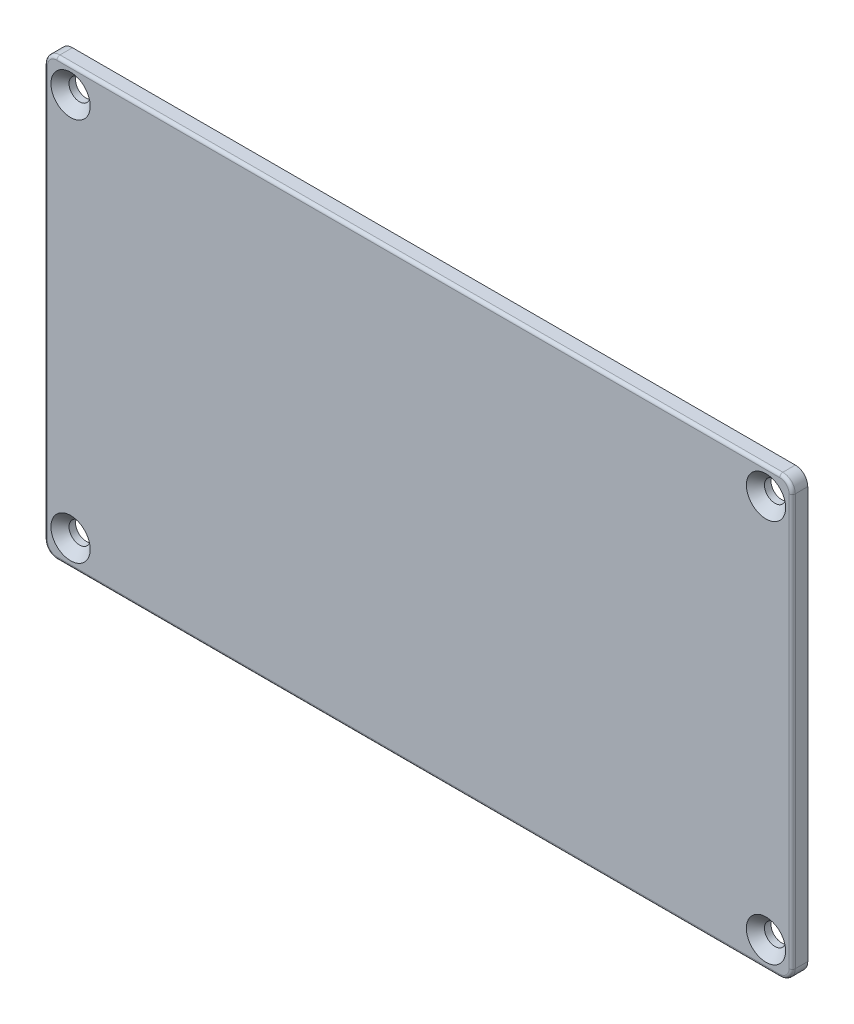
ISO-10303-21;
HEADER;
FILE_DESCRIPTION(('STEP AP214'),'2;1');
FILE_NAME('part.step','',(''),(''),'','','');
FILE_SCHEMA(('AUTOMOTIVE_DESIGN { 1 0 10303 214 1 1 1 1 }'));
ENDSEC;
DATA;
#1=APPLICATION_CONTEXT('core data for automotive mechanical design processes');
#2=APPLICATION_PROTOCOL_DEFINITION('international standard','automotive_design',2000,#1);
#3=PRODUCT_CONTEXT('',#1,'mechanical');
#4=PRODUCT('Part','Part','',(#3));
#5=PRODUCT_RELATED_PRODUCT_CATEGORY('part','',(#4));
#6=PRODUCT_DEFINITION_FORMATION('','',#4);
#7=PRODUCT_DEFINITION_CONTEXT('part definition',#1,'design');
#8=PRODUCT_DEFINITION('design','',#6,#7);
#9=PRODUCT_DEFINITION_SHAPE('','',#8);
#10=(LENGTH_UNIT() NAMED_UNIT(*) SI_UNIT(.MILLI.,.METRE.));
#11=(NAMED_UNIT(*) PLANE_ANGLE_UNIT() SI_UNIT($,.RADIAN.));
#12=(NAMED_UNIT(*) SI_UNIT($,.STERADIAN.) SOLID_ANGLE_UNIT());
#13=UNCERTAINTY_MEASURE_WITH_UNIT(LENGTH_MEASURE(1.E-05),#10,'distance_accuracy_value','');
#14=(GEOMETRIC_REPRESENTATION_CONTEXT(3) GLOBAL_UNCERTAINTY_ASSIGNED_CONTEXT((#13)) GLOBAL_UNIT_ASSIGNED_CONTEXT((#10,
#11,#12)) REPRESENTATION_CONTEXT('',''));
#15=CARTESIAN_POINT('',(0.,0.,0.));
#16=DIRECTION('',(0.,0.,1.));
#17=DIRECTION('',(1.,0.,0.));
#18=AXIS2_PLACEMENT_3D('',#15,#16,#17);
#19=CARTESIAN_POINT('',(-60.,-35.,2.5));
#20=DIRECTION('',(1.,0.,0.));
#21=DIRECTION('',(0.,0.,-1.));
#22=AXIS2_PLACEMENT_3D('',#19,#20,#21);
#23=PLANE('',#22);
#24=DIRECTION('',(0.,0.,-1.));
#25=VECTOR('',#24,1.);
#26=CARTESIAN_POINT('',(-60.,-33.,2.5));
#27=LINE('',#26,#25);
#28=CARTESIAN_POINT('',(-60.,-33.,0.));
#29=VERTEX_POINT('',#28);
#30=CARTESIAN_POINT('',(-60.,-33.,2.));
#31=VERTEX_POINT('',#30);
#32=EDGE_CURVE('E173',#29,#31,#27,.F.);
#33=ORIENTED_EDGE('',*,*,#32,.T.);
#34=DIRECTION('',(0.,-1.,0.));
#35=VECTOR('',#34,1.);
#36=CARTESIAN_POINT('',(-60.,33.,2.));
#37=LINE('',#36,#35);
#38=CARTESIAN_POINT('',(-60.,33.,2.));
#39=VERTEX_POINT('',#38);
#40=EDGE_CURVE('E11',#31,#39,#37,.F.);
#41=ORIENTED_EDGE('',*,*,#40,.T.);
#42=DIRECTION('',(0.,0.,-1.));
#43=VECTOR('',#42,1.);
#44=CARTESIAN_POINT('',(-60.,33.,2.5));
#45=LINE('',#44,#43);
#46=CARTESIAN_POINT('',(-60.,33.,0.));
#47=VERTEX_POINT('',#46);
#48=EDGE_CURVE('E171',#39,#47,#45,.T.);
#49=ORIENTED_EDGE('',*,*,#48,.T.);
#50=DIRECTION('',(0.,-1.,0.));
#51=VECTOR('',#50,1.);
#52=CARTESIAN_POINT('',(-60.,-35.,0.));
#53=LINE('',#52,#51);
#54=EDGE_CURVE('E160',#47,#29,#53,.T.);
#55=ORIENTED_EDGE('',*,*,#54,.T.);
#56=EDGE_LOOP('',(#33,#41,#49,#55));
#57=FACE_BOUND('',#56,.T.);
#58=ADVANCED_FACE('F37',(#57),#23,.F.);
#59=CARTESIAN_POINT('',(60.,-35.,2.5));
#60=DIRECTION('',(0.,1.,0.));
#61=DIRECTION('',(0.,0.,1.));
#62=AXIS2_PLACEMENT_3D('',#59,#60,#61);
#63=PLANE('',#62);
#64=DIRECTION('',(0.,0.,-1.));
#65=VECTOR('',#64,1.);
#66=CARTESIAN_POINT('',(58.,-35.,2.5));
#67=LINE('',#66,#65);
#68=CARTESIAN_POINT('',(58.,-35.,0.));
#69=VERTEX_POINT('',#68);
#70=CARTESIAN_POINT('',(58.,-35.,2.));
#71=VERTEX_POINT('',#70);
#72=EDGE_CURVE('E145',#69,#71,#67,.F.);
#73=ORIENTED_EDGE('',*,*,#72,.T.);
#74=DIRECTION('',(1.,0.,0.));
#75=VECTOR('',#74,1.);
#76=CARTESIAN_POINT('',(-58.,-35.,2.));
#77=LINE('',#76,#75);
#78=CARTESIAN_POINT('',(-58.,-35.,2.));
#79=VERTEX_POINT('',#78);
#80=EDGE_CURVE('E61',#71,#79,#77,.F.);
#81=ORIENTED_EDGE('',*,*,#80,.T.);
#82=DIRECTION('',(0.,0.,-1.));
#83=VECTOR('',#82,1.);
#84=CARTESIAN_POINT('',(-58.,-35.,2.5));
#85=LINE('',#84,#83);
#86=CARTESIAN_POINT('',(-58.,-35.,0.));
#87=VERTEX_POINT('',#86);
#88=EDGE_CURVE('E149',#79,#87,#85,.T.);
#89=ORIENTED_EDGE('',*,*,#88,.T.);
#90=DIRECTION('',(1.,0.,0.));
#91=VECTOR('',#90,1.);
#92=CARTESIAN_POINT('',(60.,-35.,0.));
#93=LINE('',#92,#91);
#94=EDGE_CURVE('E156',#87,#69,#93,.T.);
#95=ORIENTED_EDGE('',*,*,#94,.T.);
#96=EDGE_LOOP('',(#73,#81,#89,#95));
#97=FACE_BOUND('',#96,.T.);
#98=ADVANCED_FACE('F280',(#97),#63,.F.);
#99=CARTESIAN_POINT('',(60.,-35.,2.5));
#100=DIRECTION('',(-1.,0.,0.));
#101=DIRECTION('',(0.,0.,1.));
#102=AXIS2_PLACEMENT_3D('',#99,#100,#101);
#103=PLANE('',#102);
#104=DIRECTION('',(0.,0.,-1.));
#105=VECTOR('',#104,1.);
#106=CARTESIAN_POINT('',(60.,33.,2.5));
#107=LINE('',#106,#105);
#108=CARTESIAN_POINT('',(60.,33.,0.));
#109=VERTEX_POINT('',#108);
#110=CARTESIAN_POINT('',(60.,33.,2.));
#111=VERTEX_POINT('',#110);
#112=EDGE_CURVE('E140',#109,#111,#107,.F.);
#113=ORIENTED_EDGE('',*,*,#112,.T.);
#114=DIRECTION('',(0.,1.,0.));
#115=VECTOR('',#114,1.);
#116=CARTESIAN_POINT('',(60.,-33.,2.));
#117=LINE('',#116,#115);
#118=CARTESIAN_POINT('',(60.,-33.,2.));
#119=VERTEX_POINT('',#118);
#120=EDGE_CURVE('E136',#111,#119,#117,.F.);
#121=ORIENTED_EDGE('',*,*,#120,.T.);
#122=DIRECTION('',(0.,0.,-1.));
#123=VECTOR('',#122,1.);
#124=CARTESIAN_POINT('',(60.,-33.,2.5));
#125=LINE('',#124,#123);
#126=CARTESIAN_POINT('',(60.,-33.,0.));
#127=VERTEX_POINT('',#126);
#128=EDGE_CURVE('E128',#119,#127,#125,.T.);
#129=ORIENTED_EDGE('',*,*,#128,.T.);
#130=DIRECTION('',(0.,1.,0.));
#131=VECTOR('',#130,1.);
#132=CARTESIAN_POINT('',(60.,-35.,0.));
#133=LINE('',#132,#131);
#134=EDGE_CURVE('E133',#127,#109,#133,.T.);
#135=ORIENTED_EDGE('',*,*,#134,.T.);
#136=EDGE_LOOP('',(#113,#121,#129,#135));
#137=FACE_BOUND('',#136,.T.);
#138=ADVANCED_FACE('F131',(#137),#103,.F.);
#139=CARTESIAN_POINT('',(60.,35.,2.5));
#140=DIRECTION('',(0.,-1.,0.));
#141=DIRECTION('',(0.,0.,-1.));
#142=AXIS2_PLACEMENT_3D('',#139,#140,#141);
#143=PLANE('',#142);
#144=DIRECTION('',(0.,0.,-1.));
#145=VECTOR('',#144,1.);
#146=CARTESIAN_POINT('',(-58.,35.,2.5));
#147=LINE('',#146,#145);
#148=CARTESIAN_POINT('',(-58.,35.,0.));
#149=VERTEX_POINT('',#148);
#150=CARTESIAN_POINT('',(-58.,35.,2.));
#151=VERTEX_POINT('',#150);
#152=EDGE_CURVE('E177',#149,#151,#147,.F.);
#153=ORIENTED_EDGE('',*,*,#152,.T.);
#154=DIRECTION('',(-1.,0.,0.));
#155=VECTOR('',#154,1.);
#156=CARTESIAN_POINT('',(58.,35.,2.));
#157=LINE('',#156,#155);
#158=CARTESIAN_POINT('',(58.,35.,2.));
#159=VERTEX_POINT('',#158);
#160=EDGE_CURVE('E219',#151,#159,#157,.F.);
#161=ORIENTED_EDGE('',*,*,#160,.T.);
#162=DIRECTION('',(0.,0.,-1.));
#163=VECTOR('',#162,1.);
#164=CARTESIAN_POINT('',(58.,35.,2.5));
#165=LINE('',#164,#163);
#166=CARTESIAN_POINT('',(58.,35.,0.));
#167=VERTEX_POINT('',#166);
#168=EDGE_CURVE('E175',#159,#167,#165,.T.);
#169=ORIENTED_EDGE('',*,*,#168,.T.);
#170=DIRECTION('',(-1.,0.,0.));
#171=VECTOR('',#170,1.);
#172=CARTESIAN_POINT('',(60.,35.,0.));
#173=LINE('',#172,#171);
#174=EDGE_CURVE('E155',#167,#149,#173,.T.);
#175=ORIENTED_EDGE('',*,*,#174,.T.);
#176=EDGE_LOOP('',(#153,#161,#169,#175));
#177=FACE_BOUND('',#176,.T.);
#178=ADVANCED_FACE('F307',(#177),#143,.F.);
#179=CARTESIAN_POINT('',(0.,0.,2.5));
#180=DIRECTION('',(0.,0.,1.));
#181=DIRECTION('',(1.,0.,0.));
#182=AXIS2_PLACEMENT_3D('',#179,#180,#181);
#183=PLANE('',#182);
#184=DIRECTION('',(-1.,0.,0.));
#185=VECTOR('',#184,1.);
#186=CARTESIAN_POINT('',(-58.,34.5,2.5));
#187=LINE('',#186,#185);
#188=CARTESIAN_POINT('',(58.,34.5,2.5));
#189=VERTEX_POINT('',#188);
#190=CARTESIAN_POINT('',(-58.,34.5,2.5));
#191=VERTEX_POINT('',#190);
#192=EDGE_CURVE('E211',#189,#191,#187,.T.);
#193=ORIENTED_EDGE('',*,*,#192,.T.);
#194=CARTESIAN_POINT('',(-58.,33.,2.5));
#195=DIRECTION('',(0.,0.,1.));
#196=DIRECTION('',(1.,0.,0.));
#197=AXIS2_PLACEMENT_3D('',#194,#195,#196);
#198=CIRCLE('',#197,1.5);
#199=CARTESIAN_POINT('',(-59.5,33.,2.5));
#200=VERTEX_POINT('',#199);
#201=EDGE_CURVE('E213',#191,#200,#198,.T.);
#202=ORIENTED_EDGE('',*,*,#201,.T.);
#203=DIRECTION('',(0.,-1.,0.));
#204=VECTOR('',#203,1.);
#205=CARTESIAN_POINT('',(-59.5,-33.,2.5));
#206=LINE('',#205,#204);
#207=CARTESIAN_POINT('',(-59.5,-33.,2.5));
#208=VERTEX_POINT('',#207);
#209=EDGE_CURVE('E180',#200,#208,#206,.T.);
#210=ORIENTED_EDGE('',*,*,#209,.T.);
#211=CARTESIAN_POINT('',(-58.,-33.,2.5));
#212=DIRECTION('',(0.,0.,1.));
#213=DIRECTION('',(1.,0.,0.));
#214=AXIS2_PLACEMENT_3D('',#211,#212,#213);
#215=CIRCLE('',#214,1.5);
#216=CARTESIAN_POINT('',(-58.,-34.5,2.5));
#217=VERTEX_POINT('',#216);
#218=EDGE_CURVE('E201',#208,#217,#215,.T.);
#219=ORIENTED_EDGE('',*,*,#218,.T.);
#220=DIRECTION('',(1.,0.,0.));
#221=VECTOR('',#220,1.);
#222=CARTESIAN_POINT('',(58.,-34.5,2.5));
#223=LINE('',#222,#221);
#224=CARTESIAN_POINT('',(58.,-34.5,2.5));
#225=VERTEX_POINT('',#224);
#226=EDGE_CURVE('E203',#217,#225,#223,.T.);
#227=ORIENTED_EDGE('',*,*,#226,.T.);
#228=CARTESIAN_POINT('',(58.,-33.,2.5));
#229=DIRECTION('',(0.,0.,1.));
#230=DIRECTION('',(1.,0.,0.));
#231=AXIS2_PLACEMENT_3D('',#228,#229,#230);
#232=CIRCLE('',#231,1.5);
#233=CARTESIAN_POINT('',(59.5,-33.,2.5));
#234=VERTEX_POINT('',#233);
#235=EDGE_CURVE('E205',#225,#234,#232,.T.);
#236=ORIENTED_EDGE('',*,*,#235,.T.);
#237=DIRECTION('',(0.,1.,0.));
#238=VECTOR('',#237,1.);
#239=CARTESIAN_POINT('',(59.5,33.,2.5));
#240=LINE('',#239,#238);
#241=CARTESIAN_POINT('',(59.5,33.,2.5));
#242=VERTEX_POINT('',#241);
#243=EDGE_CURVE('E207',#234,#242,#240,.T.);
#244=ORIENTED_EDGE('',*,*,#243,.T.);
#245=CARTESIAN_POINT('',(58.,33.,2.5));
#246=DIRECTION('',(0.,0.,1.));
#247=DIRECTION('',(1.,0.,0.));
#248=AXIS2_PLACEMENT_3D('',#245,#246,#247);
#249=CIRCLE('',#248,1.5);
#250=EDGE_CURVE('E209',#242,#189,#249,.T.);
#251=ORIENTED_EDGE('',*,*,#250,.T.);
#252=EDGE_LOOP('',(#193,#202,#210,#219,#227,#236,#244,#251));
#253=FACE_BOUND('',#252,.T.);
#254=CARTESIAN_POINT('',(-55.8,30.8,2.5));
#255=DIRECTION('',(0.,0.,1.));
#256=DIRECTION('',(1.,0.,0.));
#257=AXIS2_PLACEMENT_3D('',#254,#255,#256);
#258=CIRCLE('',#257,3.15);
#259=CARTESIAN_POINT('',(-52.65,30.8,2.5));
#260=VERTEX_POINT('',#259);
#261=EDGE_CURVE('E249',#260,#260,#258,.T.);
#262=ORIENTED_EDGE('',*,*,#261,.F.);
#263=EDGE_LOOP('',(#262));
#264=FACE_BOUND('',#263,.T.);
#265=CARTESIAN_POINT('',(55.8,30.8,2.5));
#266=DIRECTION('',(0.,0.,1.));
#267=DIRECTION('',(1.,0.,0.));
#268=AXIS2_PLACEMENT_3D('',#265,#266,#267);
#269=CIRCLE('',#268,3.15);
#270=CARTESIAN_POINT('',(58.95,30.8,2.5));
#271=VERTEX_POINT('',#270);
#272=EDGE_CURVE('E198',#271,#271,#269,.T.);
#273=ORIENTED_EDGE('',*,*,#272,.F.);
#274=EDGE_LOOP('',(#273));
#275=FACE_BOUND('',#274,.T.);
#276=CARTESIAN_POINT('',(55.8,-30.8,2.5));
#277=DIRECTION('',(0.,0.,1.));
#278=DIRECTION('',(1.,0.,0.));
#279=AXIS2_PLACEMENT_3D('',#276,#277,#278);
#280=CIRCLE('',#279,3.15);
#281=CARTESIAN_POINT('',(58.95,-30.8,2.5));
#282=VERTEX_POINT('',#281);
#283=EDGE_CURVE('E193',#282,#282,#280,.T.);
#284=ORIENTED_EDGE('',*,*,#283,.F.);
#285=EDGE_LOOP('',(#284));
#286=FACE_BOUND('',#285,.T.);
#287=CARTESIAN_POINT('',(-55.8,-30.8,2.5));
#288=DIRECTION('',(0.,0.,1.));
#289=DIRECTION('',(1.,0.,0.));
#290=AXIS2_PLACEMENT_3D('',#287,#288,#289);
#291=CIRCLE('',#290,3.15);
#292=CARTESIAN_POINT('',(-52.65,-30.8,2.5));
#293=VERTEX_POINT('',#292);
#294=EDGE_CURVE('E188',#293,#293,#291,.T.);
#295=ORIENTED_EDGE('',*,*,#294,.F.);
#296=EDGE_LOOP('',(#295));
#297=FACE_BOUND('',#296,.T.);
#298=ADVANCED_FACE('F317',(#253,#264,#275,#286,#297),#183,.T.);
#299=CARTESIAN_POINT('',(0.,0.,0.));
#300=DIRECTION('',(0.,0.,1.));
#301=DIRECTION('',(1.,0.,0.));
#302=AXIS2_PLACEMENT_3D('',#299,#300,#301);
#303=PLANE('',#302);
#304=CARTESIAN_POINT('',(-55.8,30.8,0.));
#305=DIRECTION('',(0.,0.,1.));
#306=DIRECTION('',(1.,0.,0.));
#307=AXIS2_PLACEMENT_3D('',#304,#305,#306);
#308=CIRCLE('',#307,1.69999999999999);
#309=CARTESIAN_POINT('',(-54.1,30.8,0.));
#310=VERTEX_POINT('',#309);
#311=EDGE_CURVE('E195',#310,#310,#308,.T.);
#312=ORIENTED_EDGE('',*,*,#311,.T.);
#313=EDGE_LOOP('',(#312));
#314=FACE_BOUND('',#313,.T.);
#315=CARTESIAN_POINT('',(55.8,30.8,0.));
#316=DIRECTION('',(0.,0.,1.));
#317=DIRECTION('',(1.,0.,0.));
#318=AXIS2_PLACEMENT_3D('',#315,#316,#317);
#319=CIRCLE('',#318,1.69999999999999);
#320=CARTESIAN_POINT('',(57.5,30.8,0.));
#321=VERTEX_POINT('',#320);
#322=EDGE_CURVE('E190',#321,#321,#319,.T.);
#323=ORIENTED_EDGE('',*,*,#322,.T.);
#324=EDGE_LOOP('',(#323));
#325=FACE_BOUND('',#324,.T.);
#326=CARTESIAN_POINT('',(55.8,-30.8,0.));
#327=DIRECTION('',(0.,0.,1.));
#328=DIRECTION('',(1.,0.,0.));
#329=AXIS2_PLACEMENT_3D('',#326,#327,#328);
#330=CIRCLE('',#329,1.69999999999999);
#331=CARTESIAN_POINT('',(57.5,-30.8,0.));
#332=VERTEX_POINT('',#331);
#333=EDGE_CURVE('E185',#332,#332,#330,.T.);
#334=ORIENTED_EDGE('',*,*,#333,.T.);
#335=EDGE_LOOP('',(#334));
#336=FACE_BOUND('',#335,.T.);
#337=CARTESIAN_POINT('',(-55.8,-30.8,0.));
#338=DIRECTION('',(0.,0.,1.));
#339=DIRECTION('',(1.,0.,0.));
#340=AXIS2_PLACEMENT_3D('',#337,#338,#339);
#341=CIRCLE('',#340,1.69999999999999);
#342=CARTESIAN_POINT('',(-54.1,-30.8,0.));
#343=VERTEX_POINT('',#342);
#344=EDGE_CURVE('E181',#343,#343,#341,.T.);
#345=ORIENTED_EDGE('',*,*,#344,.T.);
#346=EDGE_LOOP('',(#345));
#347=FACE_BOUND('',#346,.T.);
#348=ORIENTED_EDGE('',*,*,#134,.F.);
#349=CARTESIAN_POINT('',(58.,-33.,0.));
#350=DIRECTION('',(0.,0.,1.));
#351=DIRECTION('',(1.,0.,0.));
#352=AXIS2_PLACEMENT_3D('',#349,#350,#351);
#353=CIRCLE('',#352,2.);
#354=EDGE_CURVE('E143',#127,#69,#353,.F.);
#355=ORIENTED_EDGE('',*,*,#354,.T.);
#356=ORIENTED_EDGE('',*,*,#94,.F.);
#357=CARTESIAN_POINT('',(-58.,-33.,0.));
#358=DIRECTION('',(0.,0.,1.));
#359=DIRECTION('',(1.,0.,0.));
#360=AXIS2_PLACEMENT_3D('',#357,#358,#359);
#361=CIRCLE('',#360,2.);
#362=EDGE_CURVE('E150',#87,#29,#361,.F.);
#363=ORIENTED_EDGE('',*,*,#362,.T.);
#364=ORIENTED_EDGE('',*,*,#54,.F.);
#365=CARTESIAN_POINT('',(-58.,33.,0.));
#366=DIRECTION('',(0.,0.,1.));
#367=DIRECTION('',(1.,0.,0.));
#368=AXIS2_PLACEMENT_3D('',#365,#366,#367);
#369=CIRCLE('',#368,2.);
#370=EDGE_CURVE('E166',#47,#149,#369,.F.);
#371=ORIENTED_EDGE('',*,*,#370,.T.);
#372=ORIENTED_EDGE('',*,*,#174,.F.);
#373=CARTESIAN_POINT('',(58.,33.,0.));
#374=DIRECTION('',(0.,0.,1.));
#375=DIRECTION('',(1.,0.,0.));
#376=AXIS2_PLACEMENT_3D('',#373,#374,#375);
#377=CIRCLE('',#376,2.);
#378=EDGE_CURVE('E139',#167,#109,#377,.F.);
#379=ORIENTED_EDGE('',*,*,#378,.T.);
#380=EDGE_LOOP('',(#348,#355,#356,#363,#364,#371,#372,#379));
#381=FACE_BOUND('',#380,.T.);
#382=ADVANCED_FACE('F152',(#314,#325,#336,#347,#381),#303,.F.);
#383=CARTESIAN_POINT('',(58.,-33.,2.5));
#384=DIRECTION('',(0.,0.,-1.));
#385=DIRECTION('',(-1.,0.,0.));
#386=AXIS2_PLACEMENT_3D('',#383,#384,#385);
#387=CYLINDRICAL_SURFACE('',#386,2.);
#388=ORIENTED_EDGE('',*,*,#128,.F.);
#389=CARTESIAN_POINT('',(58.,-33.,2.));
#390=DIRECTION('',(0.,0.,1.));
#391=DIRECTION('',(1.,0.,0.));
#392=AXIS2_PLACEMENT_3D('',#389,#390,#391);
#393=CIRCLE('',#392,2.);
#394=EDGE_CURVE('E224',#119,#71,#393,.F.);
#395=ORIENTED_EDGE('',*,*,#394,.T.);
#396=ORIENTED_EDGE('',*,*,#72,.F.);
#397=ORIENTED_EDGE('',*,*,#354,.F.);
#398=EDGE_LOOP('',(#388,#395,#396,#397));
#399=FACE_BOUND('',#398,.T.);
#400=ADVANCED_FACE('F144',(#399),#387,.T.);
#401=CARTESIAN_POINT('',(-58.,-33.,2.5));
#402=DIRECTION('',(0.,0.,-1.));
#403=DIRECTION('',(-1.,0.,0.));
#404=AXIS2_PLACEMENT_3D('',#401,#402,#403);
#405=CYLINDRICAL_SURFACE('',#404,2.);
#406=ORIENTED_EDGE('',*,*,#88,.F.);
#407=CARTESIAN_POINT('',(-58.,-33.,2.));
#408=DIRECTION('',(0.,0.,1.));
#409=DIRECTION('',(1.,0.,0.));
#410=AXIS2_PLACEMENT_3D('',#407,#408,#409);
#411=CIRCLE('',#410,2.);
#412=EDGE_CURVE('E46',#79,#31,#411,.F.);
#413=ORIENTED_EDGE('',*,*,#412,.T.);
#414=ORIENTED_EDGE('',*,*,#32,.F.);
#415=ORIENTED_EDGE('',*,*,#362,.F.);
#416=EDGE_LOOP('',(#406,#413,#414,#415));
#417=FACE_BOUND('',#416,.T.);
#418=ADVANCED_FACE('F278',(#417),#405,.T.);
#419=CARTESIAN_POINT('',(-58.,33.,2.5));
#420=DIRECTION('',(0.,0.,-1.));
#421=DIRECTION('',(-1.,0.,0.));
#422=AXIS2_PLACEMENT_3D('',#419,#420,#421);
#423=CYLINDRICAL_SURFACE('',#422,2.);
#424=ORIENTED_EDGE('',*,*,#48,.F.);
#425=CARTESIAN_POINT('',(-58.,33.,2.));
#426=DIRECTION('',(0.,0.,1.));
#427=DIRECTION('',(1.,0.,0.));
#428=AXIS2_PLACEMENT_3D('',#425,#426,#427);
#429=CIRCLE('',#428,2.);
#430=EDGE_CURVE('E216',#39,#151,#429,.F.);
#431=ORIENTED_EDGE('',*,*,#430,.T.);
#432=ORIENTED_EDGE('',*,*,#152,.F.);
#433=ORIENTED_EDGE('',*,*,#370,.F.);
#434=EDGE_LOOP('',(#424,#431,#432,#433));
#435=FACE_BOUND('',#434,.T.);
#436=ADVANCED_FACE('F294',(#435),#423,.T.);
#437=CARTESIAN_POINT('',(58.,33.,2.5));
#438=DIRECTION('',(0.,0.,-1.));
#439=DIRECTION('',(-1.,0.,0.));
#440=AXIS2_PLACEMENT_3D('',#437,#438,#439);
#441=CYLINDRICAL_SURFACE('',#440,2.);
#442=ORIENTED_EDGE('',*,*,#168,.F.);
#443=CARTESIAN_POINT('',(58.,33.,2.));
#444=DIRECTION('',(0.,0.,1.));
#445=DIRECTION('',(1.,0.,0.));
#446=AXIS2_PLACEMENT_3D('',#443,#444,#445);
#447=CIRCLE('',#446,2.);
#448=EDGE_CURVE('E221',#159,#111,#447,.F.);
#449=ORIENTED_EDGE('',*,*,#448,.T.);
#450=ORIENTED_EDGE('',*,*,#112,.F.);
#451=ORIENTED_EDGE('',*,*,#378,.F.);
#452=EDGE_LOOP('',(#442,#449,#450,#451));
#453=FACE_BOUND('',#452,.T.);
#454=ADVANCED_FACE('F310',(#453),#441,.T.);
#455=CARTESIAN_POINT('',(-55.8,-30.8,2.5));
#456=DIRECTION('',(0.,0.,1.));
#457=DIRECTION('',(1.,0.,0.));
#458=AXIS2_PLACEMENT_3D('',#455,#456,#457);
#459=CYLINDRICAL_SURFACE('',#458,1.69999999999999);
#460=CARTESIAN_POINT('',(-55.8,-30.8,1.05));
#461=DIRECTION('',(0.,0.,1.));
#462=DIRECTION('',(1.,0.,0.));
#463=AXIS2_PLACEMENT_3D('',#460,#461,#462);
#464=CIRCLE('',#463,1.7);
#465=CARTESIAN_POINT('',(-54.1,-30.8,1.05));
#466=VERTEX_POINT('',#465);
#467=EDGE_CURVE('E184',#466,#466,#464,.T.);
#468=ORIENTED_EDGE('',*,*,#467,.T.);
#469=EDGE_LOOP('',(#468));
#470=FACE_BOUND('',#469,.T.);
#471=ORIENTED_EDGE('',*,*,#344,.F.);
#472=EDGE_LOOP('',(#471));
#473=FACE_BOUND('',#472,.T.);
#474=ADVANCED_FACE('F331',(#470,#473),#459,.F.);
#475=CARTESIAN_POINT('',(-55.8,-30.8,2.5));
#476=DIRECTION('',(0.,0.,1.));
#477=DIRECTION('',(1.,0.,0.));
#478=AXIS2_PLACEMENT_3D('',#475,#476,#477);
#479=CONICAL_SURFACE('',#478,3.15,0.785398163397448);
#480=ORIENTED_EDGE('',*,*,#467,.F.);
#481=EDGE_LOOP('',(#480));
#482=FACE_BOUND('',#481,.T.);
#483=ORIENTED_EDGE('',*,*,#294,.T.);
#484=EDGE_LOOP('',(#483));
#485=FACE_BOUND('',#484,.T.);
#486=ADVANCED_FACE('F328',(#482,#485),#479,.F.);
#487=CARTESIAN_POINT('',(55.8,-30.8,2.5));
#488=DIRECTION('',(0.,0.,1.));
#489=DIRECTION('',(1.,0.,0.));
#490=AXIS2_PLACEMENT_3D('',#487,#488,#489);
#491=CYLINDRICAL_SURFACE('',#490,1.69999999999999);
#492=CARTESIAN_POINT('',(55.8,-30.8,1.05));
#493=DIRECTION('',(0.,0.,1.));
#494=DIRECTION('',(1.,0.,0.));
#495=AXIS2_PLACEMENT_3D('',#492,#493,#494);
#496=CIRCLE('',#495,1.7);
#497=CARTESIAN_POINT('',(57.5,-30.8,1.05));
#498=VERTEX_POINT('',#497);
#499=EDGE_CURVE('E189',#498,#498,#496,.T.);
#500=ORIENTED_EDGE('',*,*,#499,.T.);
#501=EDGE_LOOP('',(#500));
#502=FACE_BOUND('',#501,.T.);
#503=ORIENTED_EDGE('',*,*,#333,.F.);
#504=EDGE_LOOP('',(#503));
#505=FACE_BOUND('',#504,.T.);
#506=ADVANCED_FACE('F330',(#502,#505),#491,.F.);
#507=CARTESIAN_POINT('',(55.8,-30.8,2.5));
#508=DIRECTION('',(0.,0.,1.));
#509=DIRECTION('',(1.,0.,0.));
#510=AXIS2_PLACEMENT_3D('',#507,#508,#509);
#511=CONICAL_SURFACE('',#510,3.15,0.785398163397448);
#512=ORIENTED_EDGE('',*,*,#499,.F.);
#513=EDGE_LOOP('',(#512));
#514=FACE_BOUND('',#513,.T.);
#515=ORIENTED_EDGE('',*,*,#283,.T.);
#516=EDGE_LOOP('',(#515));
#517=FACE_BOUND('',#516,.T.);
#518=ADVANCED_FACE('F338',(#514,#517),#511,.F.);
#519=CARTESIAN_POINT('',(55.8,30.8,2.5));
#520=DIRECTION('',(0.,0.,1.));
#521=DIRECTION('',(1.,0.,0.));
#522=AXIS2_PLACEMENT_3D('',#519,#520,#521);
#523=CYLINDRICAL_SURFACE('',#522,1.69999999999999);
#524=CARTESIAN_POINT('',(55.8,30.8,1.05));
#525=DIRECTION('',(0.,0.,1.));
#526=DIRECTION('',(1.,0.,0.));
#527=AXIS2_PLACEMENT_3D('',#524,#525,#526);
#528=CIRCLE('',#527,1.7);
#529=CARTESIAN_POINT('',(57.5,30.8,1.05));
#530=VERTEX_POINT('',#529);
#531=EDGE_CURVE('E194',#530,#530,#528,.T.);
#532=ORIENTED_EDGE('',*,*,#531,.T.);
#533=EDGE_LOOP('',(#532));
#534=FACE_BOUND('',#533,.T.);
#535=ORIENTED_EDGE('',*,*,#322,.F.);
#536=EDGE_LOOP('',(#535));
#537=FACE_BOUND('',#536,.T.);
#538=ADVANCED_FACE('F392',(#534,#537),#523,.F.);
#539=CARTESIAN_POINT('',(55.8,30.8,2.5));
#540=DIRECTION('',(0.,0.,1.));
#541=DIRECTION('',(1.,0.,0.));
#542=AXIS2_PLACEMENT_3D('',#539,#540,#541);
#543=CONICAL_SURFACE('',#542,3.15,0.785398163397448);
#544=ORIENTED_EDGE('',*,*,#531,.F.);
#545=EDGE_LOOP('',(#544));
#546=FACE_BOUND('',#545,.T.);
#547=ORIENTED_EDGE('',*,*,#272,.T.);
#548=EDGE_LOOP('',(#547));
#549=FACE_BOUND('',#548,.T.);
#550=ADVANCED_FACE('F385',(#546,#549),#543,.F.);
#551=CARTESIAN_POINT('',(-55.8,30.8,2.5));
#552=DIRECTION('',(0.,0.,1.));
#553=DIRECTION('',(1.,0.,0.));
#554=AXIS2_PLACEMENT_3D('',#551,#552,#553);
#555=CYLINDRICAL_SURFACE('',#554,1.69999999999999);
#556=CARTESIAN_POINT('',(-55.8,30.8,1.05));
#557=DIRECTION('',(0.,0.,1.));
#558=DIRECTION('',(1.,0.,0.));
#559=AXIS2_PLACEMENT_3D('',#556,#557,#558);
#560=CIRCLE('',#559,1.7);
#561=CARTESIAN_POINT('',(-54.1,30.8,1.05));
#562=VERTEX_POINT('',#561);
#563=EDGE_CURVE('E199',#562,#562,#560,.T.);
#564=ORIENTED_EDGE('',*,*,#563,.T.);
#565=EDGE_LOOP('',(#564));
#566=FACE_BOUND('',#565,.T.);
#567=ORIENTED_EDGE('',*,*,#311,.F.);
#568=EDGE_LOOP('',(#567));
#569=FACE_BOUND('',#568,.T.);
#570=ADVANCED_FACE('F379',(#566,#569),#555,.F.);
#571=CARTESIAN_POINT('',(-55.8,30.8,2.5));
#572=DIRECTION('',(0.,0.,1.));
#573=DIRECTION('',(1.,0.,0.));
#574=AXIS2_PLACEMENT_3D('',#571,#572,#573);
#575=CONICAL_SURFACE('',#574,3.15,0.785398163397448);
#576=ORIENTED_EDGE('',*,*,#563,.F.);
#577=EDGE_LOOP('',(#576));
#578=FACE_BOUND('',#577,.T.);
#579=ORIENTED_EDGE('',*,*,#261,.T.);
#580=EDGE_LOOP('',(#579));
#581=FACE_BOUND('',#580,.T.);
#582=ADVANCED_FACE('F375',(#578,#581),#575,.F.);
#583=CARTESIAN_POINT('',(58.,-33.,2.));
#584=DIRECTION('',(0.,0.,1.));
#585=DIRECTION('',(1.,0.,0.));
#586=AXIS2_PLACEMENT_3D('',#583,#584,#585);
#587=TOROIDAL_SURFACE('',#586,1.5,0.5);
#588=CARTESIAN_POINT('',(58.,-34.5,2.));
#589=DIRECTION('',(-1.,0.,0.));
#590=DIRECTION('',(0.,0.,1.));
#591=AXIS2_PLACEMENT_3D('',#588,#589,#590);
#592=CIRCLE('',#591,0.5);
#593=EDGE_CURVE('E243',#71,#225,#592,.T.);
#594=ORIENTED_EDGE('',*,*,#593,.F.);
#595=ORIENTED_EDGE('',*,*,#394,.F.);
#596=CARTESIAN_POINT('',(59.5,-33.,2.));
#597=DIRECTION('',(0.,1.,0.));
#598=DIRECTION('',(0.,0.,1.));
#599=AXIS2_PLACEMENT_3D('',#596,#597,#598);
#600=CIRCLE('',#599,0.5);
#601=EDGE_CURVE('E41',#234,#119,#600,.T.);
#602=ORIENTED_EDGE('',*,*,#601,.F.);
#603=ORIENTED_EDGE('',*,*,#235,.F.);
#604=EDGE_LOOP('',(#594,#595,#602,#603));
#605=FACE_BOUND('',#604,.T.);
#606=ADVANCED_FACE('F39',(#605),#587,.T.);
#607=CARTESIAN_POINT('',(59.5,0.,2.));
#608=DIRECTION('',(0.,-1.,0.));
#609=DIRECTION('',(0.,0.,-1.));
#610=AXIS2_PLACEMENT_3D('',#607,#608,#609);
#611=CYLINDRICAL_SURFACE('',#610,0.5);
#612=ORIENTED_EDGE('',*,*,#601,.T.);
#613=ORIENTED_EDGE('',*,*,#120,.F.);
#614=CARTESIAN_POINT('',(59.5,33.,2.));
#615=DIRECTION('',(0.,1.,0.));
#616=DIRECTION('',(0.,0.,1.));
#617=AXIS2_PLACEMENT_3D('',#614,#615,#616);
#618=CIRCLE('',#617,0.5);
#619=EDGE_CURVE('E241',#242,#111,#618,.T.);
#620=ORIENTED_EDGE('',*,*,#619,.F.);
#621=ORIENTED_EDGE('',*,*,#243,.F.);
#622=EDGE_LOOP('',(#612,#613,#620,#621));
#623=FACE_BOUND('',#622,.T.);
#624=ADVANCED_FACE('F315',(#623),#611,.T.);
#625=CARTESIAN_POINT('',(0.,-34.5,2.));
#626=DIRECTION('',(-1.,0.,0.));
#627=DIRECTION('',(0.,0.,1.));
#628=AXIS2_PLACEMENT_3D('',#625,#626,#627);
#629=CYLINDRICAL_SURFACE('',#628,0.5);
#630=ORIENTED_EDGE('',*,*,#593,.T.);
#631=ORIENTED_EDGE('',*,*,#226,.F.);
#632=CARTESIAN_POINT('',(-58.,-34.5,2.));
#633=DIRECTION('',(-1.,0.,0.));
#634=DIRECTION('',(0.,0.,1.));
#635=AXIS2_PLACEMENT_3D('',#632,#633,#634);
#636=CIRCLE('',#635,0.5);
#637=EDGE_CURVE('E238',#79,#217,#636,.T.);
#638=ORIENTED_EDGE('',*,*,#637,.F.);
#639=ORIENTED_EDGE('',*,*,#80,.F.);
#640=EDGE_LOOP('',(#630,#631,#638,#639));
#641=FACE_BOUND('',#640,.T.);
#642=ADVANCED_FACE('F283',(#641),#629,.T.);
#643=CARTESIAN_POINT('',(58.,33.,2.));
#644=DIRECTION('',(0.,0.,1.));
#645=DIRECTION('',(1.,0.,0.));
#646=AXIS2_PLACEMENT_3D('',#643,#644,#645);
#647=TOROIDAL_SURFACE('',#646,1.5,0.5);
#648=ORIENTED_EDGE('',*,*,#619,.T.);
#649=ORIENTED_EDGE('',*,*,#448,.F.);
#650=CARTESIAN_POINT('',(58.,34.5,2.));
#651=DIRECTION('',(-1.,0.,0.));
#652=DIRECTION('',(0.,0.,1.));
#653=AXIS2_PLACEMENT_3D('',#650,#651,#652);
#654=CIRCLE('',#653,0.5);
#655=EDGE_CURVE('E235',#189,#159,#654,.T.);
#656=ORIENTED_EDGE('',*,*,#655,.F.);
#657=ORIENTED_EDGE('',*,*,#250,.F.);
#658=EDGE_LOOP('',(#648,#649,#656,#657));
#659=FACE_BOUND('',#658,.T.);
#660=ADVANCED_FACE('F312',(#659),#647,.T.);
#661=CARTESIAN_POINT('',(-58.,-33.,2.));
#662=DIRECTION('',(0.,0.,1.));
#663=DIRECTION('',(1.,0.,0.));
#664=AXIS2_PLACEMENT_3D('',#661,#662,#663);
#665=TOROIDAL_SURFACE('',#664,1.5,0.5);
#666=ORIENTED_EDGE('',*,*,#637,.T.);
#667=ORIENTED_EDGE('',*,*,#218,.F.);
#668=CARTESIAN_POINT('',(-59.5,-33.,2.));
#669=DIRECTION('',(0.,1.,0.));
#670=DIRECTION('',(0.,0.,1.));
#671=AXIS2_PLACEMENT_3D('',#668,#669,#670);
#672=CIRCLE('',#671,0.5);
#673=EDGE_CURVE('E232',#31,#208,#672,.T.);
#674=ORIENTED_EDGE('',*,*,#673,.F.);
#675=ORIENTED_EDGE('',*,*,#412,.F.);
#676=EDGE_LOOP('',(#666,#667,#674,#675));
#677=FACE_BOUND('',#676,.T.);
#678=ADVANCED_FACE('F286',(#677),#665,.T.);
#679=CARTESIAN_POINT('',(0.,34.5,2.));
#680=DIRECTION('',(1.,0.,0.));
#681=DIRECTION('',(0.,0.,-1.));
#682=AXIS2_PLACEMENT_3D('',#679,#680,#681);
#683=CYLINDRICAL_SURFACE('',#682,0.5);
#684=ORIENTED_EDGE('',*,*,#655,.T.);
#685=ORIENTED_EDGE('',*,*,#160,.F.);
#686=CARTESIAN_POINT('',(-58.,34.5,2.));
#687=DIRECTION('',(-1.,0.,0.));
#688=DIRECTION('',(0.,0.,1.));
#689=AXIS2_PLACEMENT_3D('',#686,#687,#688);
#690=CIRCLE('',#689,0.5);
#691=EDGE_CURVE('E230',#191,#151,#690,.T.);
#692=ORIENTED_EDGE('',*,*,#691,.F.);
#693=ORIENTED_EDGE('',*,*,#192,.F.);
#694=EDGE_LOOP('',(#684,#685,#692,#693));
#695=FACE_BOUND('',#694,.T.);
#696=ADVANCED_FACE('F303',(#695),#683,.T.);
#697=CARTESIAN_POINT('',(-59.5,0.,2.));
#698=DIRECTION('',(0.,1.,0.));
#699=DIRECTION('',(0.,0.,1.));
#700=AXIS2_PLACEMENT_3D('',#697,#698,#699);
#701=CYLINDRICAL_SURFACE('',#700,0.5);
#702=ORIENTED_EDGE('',*,*,#673,.T.);
#703=ORIENTED_EDGE('',*,*,#209,.F.);
#704=CARTESIAN_POINT('',(-59.5,33.,2.));
#705=DIRECTION('',(0.,1.,0.));
#706=DIRECTION('',(0.,0.,1.));
#707=AXIS2_PLACEMENT_3D('',#704,#705,#706);
#708=CIRCLE('',#707,0.5);
#709=EDGE_CURVE('E228',#39,#200,#708,.T.);
#710=ORIENTED_EDGE('',*,*,#709,.F.);
#711=ORIENTED_EDGE('',*,*,#40,.F.);
#712=EDGE_LOOP('',(#702,#703,#710,#711));
#713=FACE_BOUND('',#712,.T.);
#714=ADVANCED_FACE('F291',(#713),#701,.T.);
#715=CARTESIAN_POINT('',(-58.,33.,2.));
#716=DIRECTION('',(0.,0.,1.));
#717=DIRECTION('',(1.,0.,0.));
#718=AXIS2_PLACEMENT_3D('',#715,#716,#717);
#719=TOROIDAL_SURFACE('',#718,1.5,0.5);
#720=ORIENTED_EDGE('',*,*,#691,.T.);
#721=ORIENTED_EDGE('',*,*,#430,.F.);
#722=ORIENTED_EDGE('',*,*,#709,.T.);
#723=ORIENTED_EDGE('',*,*,#201,.F.);
#724=EDGE_LOOP('',(#720,#721,#722,#723));
#725=FACE_BOUND('',#724,.T.);
#726=ADVANCED_FACE('F297',(#725),#719,.T.);
#727=CLOSED_SHELL('',(#58,#98,#138,#178,#298,#382,#400,#418,#436,#454,#474,#486,#506,#518,#538,
#550,#570,#582,#606,#624,#642,#660,#678,#696,#714,#726));
#728=MANIFOLD_SOLID_BREP('B2',#727);
#729=ADVANCED_BREP_SHAPE_REPRESENTATION('',(#18,#728),#14);
#730=SHAPE_DEFINITION_REPRESENTATION(#9,#729);
ENDSEC;
END-ISO-10303-21;
